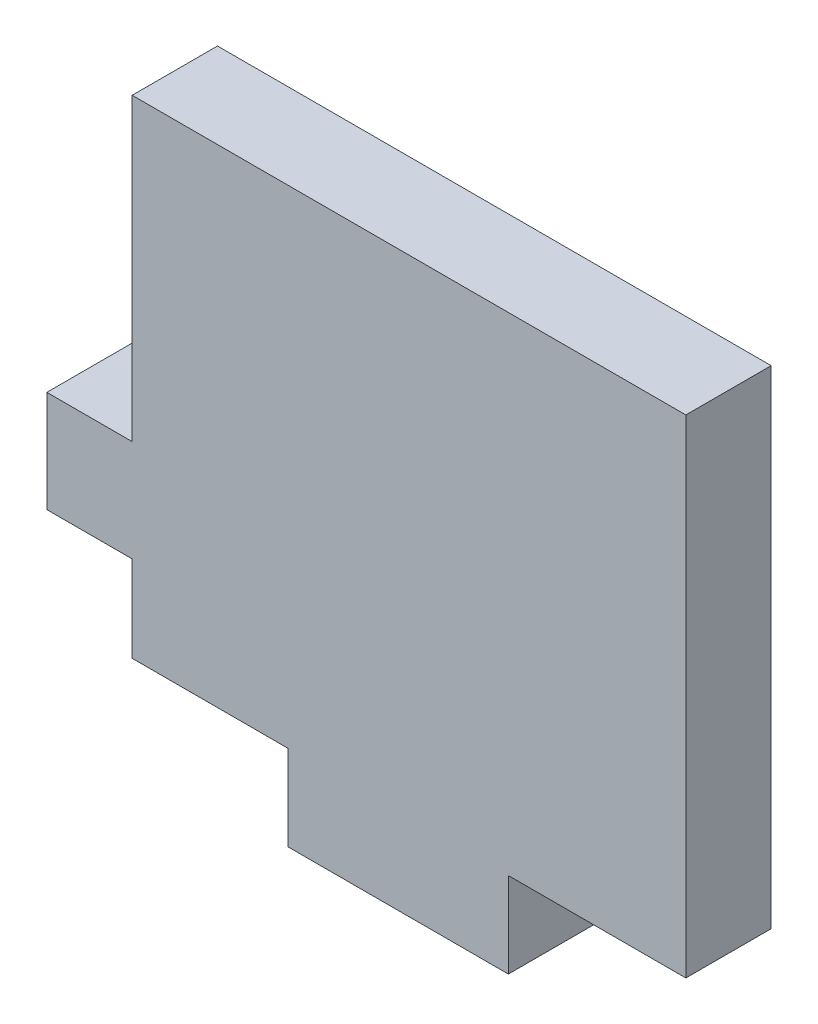
ISO-10303-21;
HEADER;
FILE_DESCRIPTION(('STEP AP214'),'2;1');
FILE_NAME('part.step','',(''),(''),'','','');
FILE_SCHEMA(('AUTOMOTIVE_DESIGN { 1 0 10303 214 1 1 1 1 }'));
ENDSEC;
DATA;
#1=APPLICATION_CONTEXT('core data for automotive mechanical design processes');
#2=APPLICATION_PROTOCOL_DEFINITION('international standard','automotive_design',2000,#1);
#3=PRODUCT_CONTEXT('',#1,'mechanical');
#4=PRODUCT('Part','Part','',(#3));
#5=PRODUCT_RELATED_PRODUCT_CATEGORY('part','',(#4));
#6=PRODUCT_DEFINITION_FORMATION('','',#4);
#7=PRODUCT_DEFINITION_CONTEXT('part definition',#1,'design');
#8=PRODUCT_DEFINITION('design','',#6,#7);
#9=PRODUCT_DEFINITION_SHAPE('','',#8);
#10=(LENGTH_UNIT() NAMED_UNIT(*) SI_UNIT(.MILLI.,.METRE.));
#11=(NAMED_UNIT(*) PLANE_ANGLE_UNIT() SI_UNIT($,.RADIAN.));
#12=(NAMED_UNIT(*) SI_UNIT($,.STERADIAN.) SOLID_ANGLE_UNIT());
#13=UNCERTAINTY_MEASURE_WITH_UNIT(LENGTH_MEASURE(1.E-05),#10,'distance_accuracy_value','');
#14=(GEOMETRIC_REPRESENTATION_CONTEXT(3) GLOBAL_UNCERTAINTY_ASSIGNED_CONTEXT((#13)) GLOBAL_UNIT_ASSIGNED_CONTEXT((#10,
#11,#12)) REPRESENTATION_CONTEXT('',''));
#15=CARTESIAN_POINT('',(0.,0.,0.));
#16=DIRECTION('',(0.,0.,1.));
#17=DIRECTION('',(1.,0.,0.));
#18=AXIS2_PLACEMENT_3D('',#15,#16,#17);
#19=CARTESIAN_POINT('',(-171.988852231813,-28.3612479474548,5.334));
#20=DIRECTION('',(0.,1.,0.));
#21=DIRECTION('',(0.,0.,1.));
#22=AXIS2_PLACEMENT_3D('',#19,#20,#21);
#23=PLANE('',#22);
#24=DIRECTION('',(0.,0.,1.));
#25=VECTOR('',#24,1.);
#26=CARTESIAN_POINT('',(-106.881835763147,-28.3612479474548,0.));
#27=LINE('',#26,#25);
#28=CARTESIAN_POINT('',(-106.881835763147,-28.3612479474548,0.));
#29=VERTEX_POINT('',#28);
#30=CARTESIAN_POINT('',(-106.881835763147,-28.3612479474548,5.334));
#31=VERTEX_POINT('',#30);
#32=EDGE_CURVE('E155',#29,#31,#27,.T.);
#33=ORIENTED_EDGE('',*,*,#32,.F.);
#34=DIRECTION('',(1.,0.,0.));
#35=VECTOR('',#34,1.);
#36=CARTESIAN_POINT('',(-171.988852231813,-28.3612479474548,0.));
#37=LINE('',#36,#35);
#38=CARTESIAN_POINT('',(-95.7888522318134,-28.3612479474548,0.));
#39=VERTEX_POINT('',#38);
#40=EDGE_CURVE('E196',#29,#39,#37,.T.);
#41=ORIENTED_EDGE('',*,*,#40,.T.);
#42=DIRECTION('',(0.,0.,-1.));
#43=VECTOR('',#42,1.);
#44=CARTESIAN_POINT('',(-95.7888522318134,-28.3612479474548,5.334));
#45=LINE('',#44,#43);
#46=CARTESIAN_POINT('',(-95.7888522318134,-28.3612479474548,5.334));
#47=VERTEX_POINT('',#46);
#48=EDGE_CURVE('E218',#47,#39,#45,.T.);
#49=ORIENTED_EDGE('',*,*,#48,.F.);
#50=DIRECTION('',(1.,0.,0.));
#51=VECTOR('',#50,1.);
#52=CARTESIAN_POINT('',(-171.988852231813,-28.3612479474548,5.334));
#53=LINE('',#52,#51);
#54=EDGE_CURVE('E237',#31,#47,#53,.T.);
#55=ORIENTED_EDGE('',*,*,#54,.F.);
#56=EDGE_LOOP('',(#33,#41,#49,#55));
#57=FACE_BOUND('',#56,.T.);
#58=ADVANCED_FACE('F33',(#57),#23,.F.);
#59=CARTESIAN_POINT('',(-130.396352231813,7.488855574737,-10.3612830354487));
#60=DIRECTION('',(-1.,0.,0.));
#61=DIRECTION('',(0.,1.,0.));
#62=AXIS2_PLACEMENT_3D('',#59,#60,#61);
#63=PLANE('',#62);
#64=DIRECTION('',(0.,-1.,0.));
#65=VECTOR('',#64,1.);
#66=CARTESIAN_POINT('',(-130.396352231813,-28.3612479474549,0.));
#67=LINE('',#66,#65);
#68=CARTESIAN_POINT('',(-130.396352231813,2.11875205254515,0.));
#69=VERTEX_POINT('',#68);
#70=CARTESIAN_POINT('',(-130.396352231813,-16.6287418102632,0.));
#71=VERTEX_POINT('',#70);
#72=EDGE_CURVE('E42',#69,#71,#67,.T.);
#73=ORIENTED_EDGE('',*,*,#72,.T.);
#74=DIRECTION('',(0.,0.,1.));
#75=VECTOR('',#74,1.);
#76=CARTESIAN_POINT('',(-130.396352231813,-16.6287418102632,0.));
#77=LINE('',#76,#75);
#78=CARTESIAN_POINT('',(-130.396352231813,-16.6287418102632,5.334));
#79=VERTEX_POINT('',#78);
#80=EDGE_CURVE('E185',#71,#79,#77,.T.);
#81=ORIENTED_EDGE('',*,*,#80,.T.);
#82=DIRECTION('',(0.,-1.,0.));
#83=VECTOR('',#82,1.);
#84=CARTESIAN_POINT('',(-130.396352231813,-28.3612479474549,5.334));
#85=LINE('',#84,#83);
#86=CARTESIAN_POINT('',(-130.396352231813,2.11875205254515,5.334));
#87=VERTEX_POINT('',#86);
#88=EDGE_CURVE('E235',#87,#79,#85,.T.);
#89=ORIENTED_EDGE('',*,*,#88,.F.);
#90=DIRECTION('',(0.,0.,-1.));
#91=VECTOR('',#90,1.);
#92=CARTESIAN_POINT('',(-130.396352231813,2.11875205254515,5.334));
#93=LINE('',#92,#91);
#94=EDGE_CURVE('E221',#87,#69,#93,.T.);
#95=ORIENTED_EDGE('',*,*,#94,.T.);
#96=EDGE_LOOP('',(#73,#81,#89,#95));
#97=FACE_BOUND('',#96,.T.);
#98=ADVANCED_FACE('F274',(#97),#63,.T.);
#99=CARTESIAN_POINT('',(-171.988852231813,2.11875205254515,5.334));
#100=DIRECTION('',(0.,-1.,0.));
#101=DIRECTION('',(0.,0.,-1.));
#102=AXIS2_PLACEMENT_3D('',#99,#100,#101);
#103=PLANE('',#102);
#104=ORIENTED_EDGE('',*,*,#94,.F.);
#105=DIRECTION('',(-1.,0.,0.));
#106=VECTOR('',#105,1.);
#107=CARTESIAN_POINT('',(-171.988852231813,2.11875205254515,5.334));
#108=LINE('',#107,#106);
#109=CARTESIAN_POINT('',(-95.7888522318134,2.11875205254515,5.334));
#110=VERTEX_POINT('',#109);
#111=EDGE_CURVE('E195',#110,#87,#108,.T.);
#112=ORIENTED_EDGE('',*,*,#111,.F.);
#113=DIRECTION('',(0.,0.,-1.));
#114=VECTOR('',#113,1.);
#115=CARTESIAN_POINT('',(-95.7888522318134,2.11875205254515,5.334));
#116=LINE('',#115,#114);
#117=CARTESIAN_POINT('',(-95.7888522318134,2.11875205254515,0.));
#118=VERTEX_POINT('',#117);
#119=EDGE_CURVE('E181',#110,#118,#116,.T.);
#120=ORIENTED_EDGE('',*,*,#119,.T.);
#121=DIRECTION('',(-1.,0.,0.));
#122=VECTOR('',#121,1.);
#123=CARTESIAN_POINT('',(-171.988852231813,2.11875205254515,0.));
#124=LINE('',#123,#122);
#125=EDGE_CURVE('E202',#118,#69,#124,.T.);
#126=ORIENTED_EDGE('',*,*,#125,.T.);
#127=EDGE_LOOP('',(#104,#112,#120,#126));
#128=FACE_BOUND('',#127,.T.);
#129=ADVANCED_FACE('F35',(#128),#103,.F.);
#130=CARTESIAN_POINT('',(-130.396352231813,-28.3612479474548,0.));
#131=VERTEX_POINT('',#130);
#132=CARTESIAN_POINT('',(-120.670105329381,-28.3612479474548,0.));
#133=VERTEX_POINT('',#132);
#134=EDGE_CURVE('E192',#131,#133,#37,.T.);
#135=ORIENTED_EDGE('',*,*,#134,.T.);
#136=DIRECTION('',(0.,0.,1.));
#137=VECTOR('',#136,1.);
#138=CARTESIAN_POINT('',(-120.670105329381,-28.3612479474548,0.));
#139=LINE('',#138,#137);
#140=CARTESIAN_POINT('',(-120.670105329381,-28.3612479474548,5.334));
#141=VERTEX_POINT('',#140);
#142=EDGE_CURVE('E145',#133,#141,#139,.T.);
#143=ORIENTED_EDGE('',*,*,#142,.T.);
#144=CARTESIAN_POINT('',(-130.396352231813,-28.3612479474548,5.334));
#145=VERTEX_POINT('',#144);
#146=EDGE_CURVE('E228',#145,#141,#53,.T.);
#147=ORIENTED_EDGE('',*,*,#146,.F.);
#148=DIRECTION('',(0.,0.,1.));
#149=VECTOR('',#148,1.);
#150=CARTESIAN_POINT('',(-130.396352231813,-28.3612479474548,5.334));
#151=LINE('',#150,#149);
#152=EDGE_CURVE('E11',#131,#145,#151,.T.);
#153=ORIENTED_EDGE('',*,*,#152,.F.);
#154=EDGE_LOOP('',(#135,#143,#147,#153));
#155=FACE_BOUND('',#154,.T.);
#156=ADVANCED_FACE('F257',(#155),#23,.F.);
#157=CARTESIAN_POINT('',(-95.7888522318134,-28.3612479474548,5.334));
#158=DIRECTION('',(0.,0.,1.));
#159=DIRECTION('',(1.,0.,0.));
#160=AXIS2_PLACEMENT_3D('',#157,#158,#159);
#161=PLANE('',#160);
#162=ORIENTED_EDGE('',*,*,#111,.T.);
#163=ORIENTED_EDGE('',*,*,#88,.T.);
#164=DIRECTION('',(-1.,0.,0.));
#165=VECTOR('',#164,1.);
#166=CARTESIAN_POINT('',(-130.396352231813,-16.6287418102632,5.334));
#167=LINE('',#166,#165);
#168=CARTESIAN_POINT('',(-135.730352231813,-16.6287418102632,5.334));
#169=VERTEX_POINT('',#168);
#170=EDGE_CURVE('E58',#79,#169,#167,.T.);
#171=ORIENTED_EDGE('',*,*,#170,.T.);
#172=DIRECTION('',(0.,-1.,0.));
#173=VECTOR('',#172,1.);
#174=CARTESIAN_POINT('',(-135.730352231813,-16.6287418102632,5.334));
#175=LINE('',#174,#173);
#176=CARTESIAN_POINT('',(-135.730352231813,-22.9787418102632,5.334));
#177=VERTEX_POINT('',#176);
#178=EDGE_CURVE('E169',#169,#177,#175,.T.);
#179=ORIENTED_EDGE('',*,*,#178,.T.);
#180=DIRECTION('',(1.,0.,0.));
#181=VECTOR('',#180,1.);
#182=CARTESIAN_POINT('',(-130.396352231813,-22.9787418102632,5.334));
#183=LINE('',#182,#181);
#184=CARTESIAN_POINT('',(-130.396352231813,-22.9787418102632,5.334));
#185=VERTEX_POINT('',#184);
#186=EDGE_CURVE('E172',#177,#185,#183,.T.);
#187=ORIENTED_EDGE('',*,*,#186,.T.);
#188=EDGE_CURVE('E233',#185,#145,#85,.T.);
#189=ORIENTED_EDGE('',*,*,#188,.T.);
#190=ORIENTED_EDGE('',*,*,#146,.T.);
#191=DIRECTION('',(0.,-1.,0.));
#192=VECTOR('',#191,1.);
#193=CARTESIAN_POINT('',(-120.670105329381,-28.3612479474548,5.334));
#194=LINE('',#193,#192);
#195=CARTESIAN_POINT('',(-120.670105329381,-33.6952479474548,5.334));
#196=VERTEX_POINT('',#195);
#197=EDGE_CURVE('E50',#141,#196,#194,.T.);
#198=ORIENTED_EDGE('',*,*,#197,.T.);
#199=DIRECTION('',(1.,0.,0.));
#200=VECTOR('',#199,1.);
#201=CARTESIAN_POINT('',(-120.670105329381,-33.6952479474548,5.334));
#202=LINE('',#201,#200);
#203=CARTESIAN_POINT('',(-106.881835763147,-33.6952479474548,5.334));
#204=VERTEX_POINT('',#203);
#205=EDGE_CURVE('E129',#196,#204,#202,.T.);
#206=ORIENTED_EDGE('',*,*,#205,.T.);
#207=DIRECTION('',(0.,1.,0.));
#208=VECTOR('',#207,1.);
#209=CARTESIAN_POINT('',(-106.881835763147,-28.3612479474548,5.334));
#210=LINE('',#209,#208);
#211=EDGE_CURVE('E146',#204,#31,#210,.T.);
#212=ORIENTED_EDGE('',*,*,#211,.T.);
#213=ORIENTED_EDGE('',*,*,#54,.T.);
#214=DIRECTION('',(0.,1.,0.));
#215=VECTOR('',#214,1.);
#216=CARTESIAN_POINT('',(-95.7888522318134,2.11875205254515,5.334));
#217=LINE('',#216,#215);
#218=EDGE_CURVE('E225',#47,#110,#217,.T.);
#219=ORIENTED_EDGE('',*,*,#218,.T.);
#220=EDGE_LOOP('',(#162,#163,#171,#179,#187,#189,#190,#198,#206,#212,#213,#219));
#221=FACE_BOUND('',#220,.T.);
#222=ADVANCED_FACE('F243',(#221),#161,.T.);
#223=CARTESIAN_POINT('',(-95.7888522318134,-28.3612479474548,0.));
#224=DIRECTION('',(0.,0.,1.));
#225=DIRECTION('',(1.,0.,0.));
#226=AXIS2_PLACEMENT_3D('',#223,#224,#225);
#227=PLANE('',#226);
#228=ORIENTED_EDGE('',*,*,#72,.F.);
#229=ORIENTED_EDGE('',*,*,#125,.F.);
#230=DIRECTION('',(0.,1.,0.));
#231=VECTOR('',#230,1.);
#232=CARTESIAN_POINT('',(-95.7888522318134,2.11875205254515,0.));
#233=LINE('',#232,#231);
#234=EDGE_CURVE('E222',#39,#118,#233,.T.);
#235=ORIENTED_EDGE('',*,*,#234,.F.);
#236=ORIENTED_EDGE('',*,*,#40,.F.);
#237=DIRECTION('',(0.,1.,0.));
#238=VECTOR('',#237,1.);
#239=CARTESIAN_POINT('',(-106.881835763147,-28.3612479474548,0.));
#240=LINE('',#239,#238);
#241=CARTESIAN_POINT('',(-106.881835763147,-33.6952479474548,0.));
#242=VERTEX_POINT('',#241);
#243=EDGE_CURVE('E132',#242,#29,#240,.T.);
#244=ORIENTED_EDGE('',*,*,#243,.F.);
#245=DIRECTION('',(1.,0.,0.));
#246=VECTOR('',#245,1.);
#247=CARTESIAN_POINT('',(-120.670105329381,-33.6952479474548,0.));
#248=LINE('',#247,#246);
#249=CARTESIAN_POINT('',(-120.670105329381,-33.6952479474548,0.));
#250=VERTEX_POINT('',#249);
#251=EDGE_CURVE('E127',#250,#242,#248,.T.);
#252=ORIENTED_EDGE('',*,*,#251,.F.);
#253=DIRECTION('',(0.,-1.,0.));
#254=VECTOR('',#253,1.);
#255=CARTESIAN_POINT('',(-120.670105329381,-28.3612479474548,0.));
#256=LINE('',#255,#254);
#257=EDGE_CURVE('E140',#133,#250,#256,.T.);
#258=ORIENTED_EDGE('',*,*,#257,.F.);
#259=ORIENTED_EDGE('',*,*,#134,.F.);
#260=CARTESIAN_POINT('',(-130.396352231813,-22.9787418102632,0.));
#261=VERTEX_POINT('',#260);
#262=EDGE_CURVE('E209',#261,#131,#67,.T.);
#263=ORIENTED_EDGE('',*,*,#262,.F.);
#264=DIRECTION('',(1.,0.,0.));
#265=VECTOR('',#264,1.);
#266=CARTESIAN_POINT('',(-130.396352231813,-22.9787418102632,0.));
#267=LINE('',#266,#265);
#268=CARTESIAN_POINT('',(-135.730352231813,-22.9787418102632,0.));
#269=VERTEX_POINT('',#268);
#270=EDGE_CURVE('E167',#269,#261,#267,.T.);
#271=ORIENTED_EDGE('',*,*,#270,.F.);
#272=DIRECTION('',(0.,-1.,0.));
#273=VECTOR('',#272,1.);
#274=CARTESIAN_POINT('',(-135.730352231813,-16.6287418102632,0.));
#275=LINE('',#274,#273);
#276=CARTESIAN_POINT('',(-135.730352231813,-16.6287418102632,0.));
#277=VERTEX_POINT('',#276);
#278=EDGE_CURVE('E164',#277,#269,#275,.T.);
#279=ORIENTED_EDGE('',*,*,#278,.F.);
#280=DIRECTION('',(-1.,0.,0.));
#281=VECTOR('',#280,1.);
#282=CARTESIAN_POINT('',(-130.396352231813,-16.6287418102632,0.));
#283=LINE('',#282,#281);
#284=EDGE_CURVE('E168',#71,#277,#283,.T.);
#285=ORIENTED_EDGE('',*,*,#284,.F.);
#286=EDGE_LOOP('',(#228,#229,#235,#236,#244,#252,#258,#259,#263,#271,#279,#285));
#287=FACE_BOUND('',#286,.T.);
#288=ADVANCED_FACE('F138',(#287),#227,.F.);
#289=CARTESIAN_POINT('',(-95.7888522318134,2.11875205254515,5.334));
#290=DIRECTION('',(-1.,0.,0.));
#291=DIRECTION('',(0.,0.,1.));
#292=AXIS2_PLACEMENT_3D('',#289,#290,#291);
#293=PLANE('',#292);
#294=ORIENTED_EDGE('',*,*,#234,.T.);
#295=ORIENTED_EDGE('',*,*,#119,.F.);
#296=ORIENTED_EDGE('',*,*,#218,.F.);
#297=ORIENTED_EDGE('',*,*,#48,.T.);
#298=EDGE_LOOP('',(#294,#295,#296,#297));
#299=FACE_BOUND('',#298,.T.);
#300=ADVANCED_FACE('F270',(#299),#293,.F.);
#301=DIRECTION('',(0.,0.,1.));
#302=VECTOR('',#301,1.);
#303=CARTESIAN_POINT('',(-130.396352231813,-22.9787418102632,0.));
#304=LINE('',#303,#302);
#305=EDGE_CURVE('E178',#261,#185,#304,.T.);
#306=ORIENTED_EDGE('',*,*,#305,.F.);
#307=ORIENTED_EDGE('',*,*,#262,.T.);
#308=ORIENTED_EDGE('',*,*,#152,.T.);
#309=ORIENTED_EDGE('',*,*,#188,.F.);
#310=EDGE_LOOP('',(#306,#307,#308,#309));
#311=FACE_BOUND('',#310,.T.);
#312=ADVANCED_FACE('F253',(#311),#63,.T.);
#313=CARTESIAN_POINT('',(-130.396352231813,-22.9787418102632,0.));
#314=DIRECTION('',(0.,-1.,0.));
#315=DIRECTION('',(1.,0.,0.));
#316=AXIS2_PLACEMENT_3D('',#313,#314,#315);
#317=PLANE('',#316);
#318=ORIENTED_EDGE('',*,*,#186,.F.);
#319=DIRECTION('',(0.,0.,1.));
#320=VECTOR('',#319,1.);
#321=CARTESIAN_POINT('',(-135.730352231813,-22.9787418102632,0.));
#322=LINE('',#321,#320);
#323=EDGE_CURVE('E175',#269,#177,#322,.T.);
#324=ORIENTED_EDGE('',*,*,#323,.F.);
#325=ORIENTED_EDGE('',*,*,#270,.T.);
#326=ORIENTED_EDGE('',*,*,#305,.T.);
#327=EDGE_LOOP('',(#318,#324,#325,#326));
#328=FACE_BOUND('',#327,.T.);
#329=ADVANCED_FACE('F285',(#328),#317,.T.);
#330=CARTESIAN_POINT('',(-135.730352231813,-16.6287418102632,0.));
#331=DIRECTION('',(-1.,0.,0.));
#332=DIRECTION('',(0.,0.,1.));
#333=AXIS2_PLACEMENT_3D('',#330,#331,#332);
#334=PLANE('',#333);
#335=ORIENTED_EDGE('',*,*,#178,.F.);
#336=DIRECTION('',(0.,0.,1.));
#337=VECTOR('',#336,1.);
#338=CARTESIAN_POINT('',(-135.730352231813,-16.6287418102632,0.));
#339=LINE('',#338,#337);
#340=EDGE_CURVE('E275',#277,#169,#339,.T.);
#341=ORIENTED_EDGE('',*,*,#340,.F.);
#342=ORIENTED_EDGE('',*,*,#278,.T.);
#343=ORIENTED_EDGE('',*,*,#323,.T.);
#344=EDGE_LOOP('',(#335,#341,#342,#343));
#345=FACE_BOUND('',#344,.T.);
#346=ADVANCED_FACE('F282',(#345),#334,.T.);
#347=CARTESIAN_POINT('',(-130.396352231813,-16.6287418102632,0.));
#348=DIRECTION('',(0.,1.,0.));
#349=DIRECTION('',(0.,0.,1.));
#350=AXIS2_PLACEMENT_3D('',#347,#348,#349);
#351=PLANE('',#350);
#352=ORIENTED_EDGE('',*,*,#170,.F.);
#353=ORIENTED_EDGE('',*,*,#80,.F.);
#354=ORIENTED_EDGE('',*,*,#284,.T.);
#355=ORIENTED_EDGE('',*,*,#340,.T.);
#356=EDGE_LOOP('',(#352,#353,#354,#355));
#357=FACE_BOUND('',#356,.T.);
#358=ADVANCED_FACE('F279',(#357),#351,.T.);
#359=CARTESIAN_POINT('',(-120.670105329381,-28.3612479474548,0.));
#360=DIRECTION('',(-1.,0.,0.));
#361=DIRECTION('',(0.,0.,1.));
#362=AXIS2_PLACEMENT_3D('',#359,#360,#361);
#363=PLANE('',#362);
#364=ORIENTED_EDGE('',*,*,#197,.F.);
#365=ORIENTED_EDGE('',*,*,#142,.F.);
#366=ORIENTED_EDGE('',*,*,#257,.T.);
#367=DIRECTION('',(0.,0.,1.));
#368=VECTOR('',#367,1.);
#369=CARTESIAN_POINT('',(-120.670105329381,-33.6952479474548,0.));
#370=LINE('',#369,#368);
#371=EDGE_CURVE('E124',#250,#196,#370,.T.);
#372=ORIENTED_EDGE('',*,*,#371,.T.);
#373=EDGE_LOOP('',(#364,#365,#366,#372));
#374=FACE_BOUND('',#373,.T.);
#375=ADVANCED_FACE('F144',(#374),#363,.T.);
#376=CARTESIAN_POINT('',(-106.881835763147,-28.3612479474548,0.));
#377=DIRECTION('',(1.,0.,0.));
#378=DIRECTION('',(0.,0.,-1.));
#379=AXIS2_PLACEMENT_3D('',#376,#377,#378);
#380=PLANE('',#379);
#381=ORIENTED_EDGE('',*,*,#211,.F.);
#382=DIRECTION('',(0.,0.,1.));
#383=VECTOR('',#382,1.);
#384=CARTESIAN_POINT('',(-106.881835763147,-33.6952479474548,0.));
#385=LINE('',#384,#383);
#386=EDGE_CURVE('E131',#242,#204,#385,.T.);
#387=ORIENTED_EDGE('',*,*,#386,.F.);
#388=ORIENTED_EDGE('',*,*,#243,.T.);
#389=ORIENTED_EDGE('',*,*,#32,.T.);
#390=EDGE_LOOP('',(#381,#387,#388,#389));
#391=FACE_BOUND('',#390,.T.);
#392=ADVANCED_FACE('F380',(#391),#380,.T.);
#393=CARTESIAN_POINT('',(-120.670105329381,-33.6952479474548,0.));
#394=DIRECTION('',(0.,-1.,0.));
#395=DIRECTION('',(0.,0.,-1.));
#396=AXIS2_PLACEMENT_3D('',#393,#394,#395);
#397=PLANE('',#396);
#398=ORIENTED_EDGE('',*,*,#205,.F.);
#399=ORIENTED_EDGE('',*,*,#371,.F.);
#400=ORIENTED_EDGE('',*,*,#251,.T.);
#401=ORIENTED_EDGE('',*,*,#386,.T.);
#402=EDGE_LOOP('',(#398,#399,#400,#401));
#403=FACE_BOUND('',#402,.T.);
#404=ADVANCED_FACE('F126',(#403),#397,.T.);
#405=CLOSED_SHELL('',(#58,#98,#129,#156,#222,#288,#300,#312,#329,#346,#358,#375,#392,#404));
#406=MANIFOLD_SOLID_BREP('B2',#405);
#407=ADVANCED_BREP_SHAPE_REPRESENTATION('',(#18,#406),#14);
#408=SHAPE_DEFINITION_REPRESENTATION(#9,#407);
ENDSEC;
END-ISO-10303-21;
